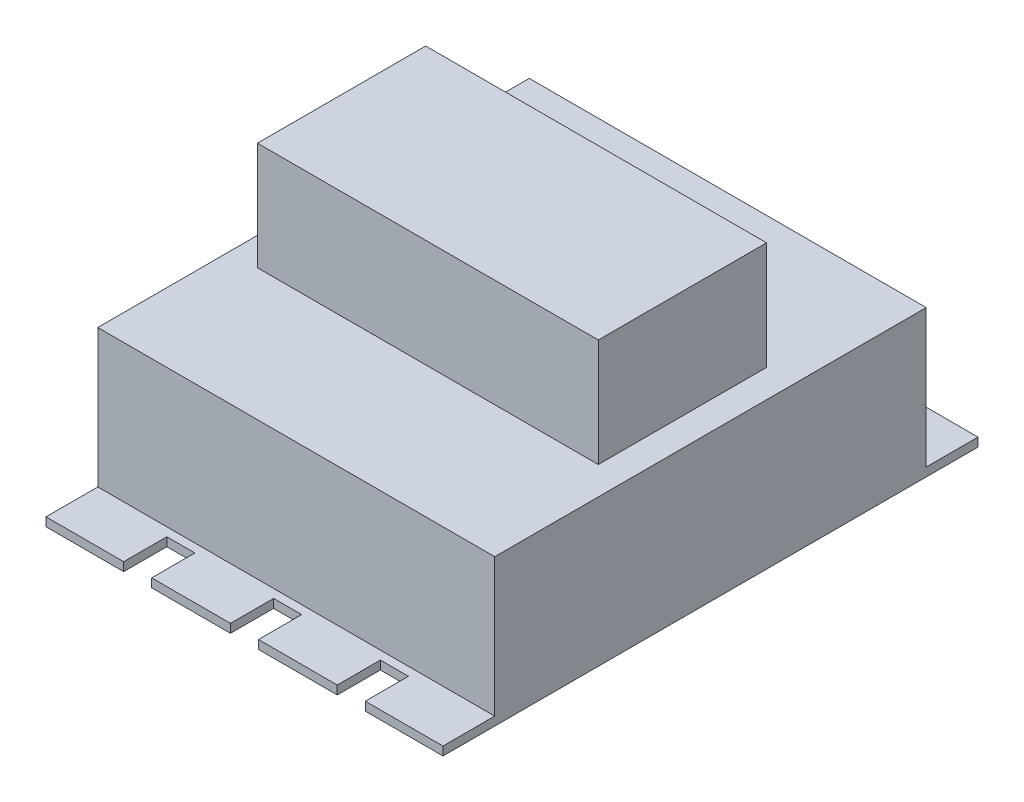
ISO-10303-21;
HEADER;
FILE_DESCRIPTION(('STEP AP214'),'2;1');
FILE_NAME('part.step','',(''),(''),'','','');
FILE_SCHEMA(('AUTOMOTIVE_DESIGN { 1 0 10303 214 1 1 1 1 }'));
ENDSEC;
DATA;
#1=APPLICATION_CONTEXT('core data for automotive mechanical design processes');
#2=APPLICATION_PROTOCOL_DEFINITION('international standard','automotive_design',2000,#1);
#3=PRODUCT_CONTEXT('',#1,'mechanical');
#4=PRODUCT('Part','Part','',(#3));
#5=PRODUCT_RELATED_PRODUCT_CATEGORY('part','',(#4));
#6=PRODUCT_DEFINITION_FORMATION('','',#4);
#7=PRODUCT_DEFINITION_CONTEXT('part definition',#1,'design');
#8=PRODUCT_DEFINITION('design','',#6,#7);
#9=PRODUCT_DEFINITION_SHAPE('','',#8);
#10=(LENGTH_UNIT() NAMED_UNIT(*) SI_UNIT(.MILLI.,.METRE.));
#11=(NAMED_UNIT(*) PLANE_ANGLE_UNIT() SI_UNIT($,.RADIAN.));
#12=(NAMED_UNIT(*) SI_UNIT($,.STERADIAN.) SOLID_ANGLE_UNIT());
#13=UNCERTAINTY_MEASURE_WITH_UNIT(LENGTH_MEASURE(1.E-05),#10,'distance_accuracy_value','');
#14=(GEOMETRIC_REPRESENTATION_CONTEXT(3) GLOBAL_UNCERTAINTY_ASSIGNED_CONTEXT((#13)) GLOBAL_UNIT_ASSIGNED_CONTEXT((#10,
#11,#12)) REPRESENTATION_CONTEXT('',''));
#15=CARTESIAN_POINT('',(0.,0.,0.));
#16=DIRECTION('',(0.,0.,1.));
#17=DIRECTION('',(1.,0.,0.));
#18=AXIS2_PLACEMENT_3D('',#15,#16,#17);
#19=CARTESIAN_POINT('',(0.,34.,0.));
#20=DIRECTION('',(0.,0.,-1.));
#21=DIRECTION('',(-1.,0.,0.));
#22=AXIS2_PLACEMENT_3D('',#19,#20,#21);
#23=PLANE('',#22);
#24=DIRECTION('',(-1.,0.,0.));
#25=VECTOR('',#24,1.);
#26=CARTESIAN_POINT('',(0.,2.,0.));
#27=LINE('',#26,#25);
#28=CARTESIAN_POINT('',(92.,2.,0.));
#29=VERTEX_POINT('',#28);
#30=CARTESIAN_POINT('',(0.,2.,0.));
#31=VERTEX_POINT('',#30);
#32=EDGE_CURVE('E54',#29,#31,#27,.T.);
#33=ORIENTED_EDGE('',*,*,#32,.F.);
#34=DIRECTION('',(0.,-1.,0.));
#35=VECTOR('',#34,1.);
#36=CARTESIAN_POINT('',(92.,34.,0.));
#37=LINE('',#36,#35);
#38=CARTESIAN_POINT('',(92.,34.,0.));
#39=VERTEX_POINT('',#38);
#40=EDGE_CURVE('E554',#39,#29,#37,.T.);
#41=ORIENTED_EDGE('',*,*,#40,.F.);
#42=DIRECTION('',(1.,0.,0.));
#43=VECTOR('',#42,1.);
#44=CARTESIAN_POINT('',(0.,34.,0.));
#45=LINE('',#44,#43);
#46=CARTESIAN_POINT('',(0.,34.,0.));
#47=VERTEX_POINT('',#46);
#48=EDGE_CURVE('E542',#47,#39,#45,.T.);
#49=ORIENTED_EDGE('',*,*,#48,.F.);
#50=DIRECTION('',(0.,-1.,0.));
#51=VECTOR('',#50,1.);
#52=CARTESIAN_POINT('',(0.,34.,0.));
#53=LINE('',#52,#51);
#54=EDGE_CURVE('E44',#47,#31,#53,.T.);
#55=ORIENTED_EDGE('',*,*,#54,.T.);
#56=EDGE_LOOP('',(#33,#41,#49,#55));
#57=FACE_BOUND('',#56,.T.);
#58=ADVANCED_FACE('F36',(#57),#23,.F.);
#59=CARTESIAN_POINT('',(0.,34.,-100.));
#60=DIRECTION('',(0.,0.,1.));
#61=DIRECTION('',(1.,0.,0.));
#62=AXIS2_PLACEMENT_3D('',#59,#60,#61);
#63=PLANE('',#62);
#64=DIRECTION('',(1.,0.,0.));
#65=VECTOR('',#64,1.);
#66=CARTESIAN_POINT('',(0.,2.,-100.));
#67=LINE('',#66,#65);
#68=CARTESIAN_POINT('',(0.,2.,-100.));
#69=VERTEX_POINT('',#68);
#70=CARTESIAN_POINT('',(92.,2.,-100.));
#71=VERTEX_POINT('',#70);
#72=EDGE_CURVE('E11',#69,#71,#67,.T.);
#73=ORIENTED_EDGE('',*,*,#72,.F.);
#74=DIRECTION('',(0.,-1.,0.));
#75=VECTOR('',#74,1.);
#76=CARTESIAN_POINT('',(0.,34.,-100.));
#77=LINE('',#76,#75);
#78=CARTESIAN_POINT('',(0.,34.,-100.));
#79=VERTEX_POINT('',#78);
#80=EDGE_CURVE('E274',#79,#69,#77,.T.);
#81=ORIENTED_EDGE('',*,*,#80,.F.);
#82=DIRECTION('',(-1.,0.,0.));
#83=VECTOR('',#82,1.);
#84=CARTESIAN_POINT('',(0.,34.,-100.));
#85=LINE('',#84,#83);
#86=CARTESIAN_POINT('',(92.,34.,-100.));
#87=VERTEX_POINT('',#86);
#88=EDGE_CURVE('E547',#87,#79,#85,.T.);
#89=ORIENTED_EDGE('',*,*,#88,.F.);
#90=DIRECTION('',(0.,-1.,0.));
#91=VECTOR('',#90,1.);
#92=CARTESIAN_POINT('',(92.,34.,-100.));
#93=LINE('',#92,#91);
#94=EDGE_CURVE('E552',#87,#71,#93,.T.);
#95=ORIENTED_EDGE('',*,*,#94,.T.);
#96=EDGE_LOOP('',(#73,#81,#89,#95));
#97=FACE_BOUND('',#96,.T.);
#98=ADVANCED_FACE('F586',(#97),#63,.F.);
#99=CARTESIAN_POINT('',(0.,34.,0.));
#100=DIRECTION('',(0.,-1.,0.));
#101=DIRECTION('',(0.,0.,-1.));
#102=AXIS2_PLACEMENT_3D('',#99,#100,#101);
#103=PLANE('',#102);
#104=DIRECTION('',(0.,0.,1.));
#105=VECTOR('',#104,1.);
#106=CARTESIAN_POINT('',(0.,34.,0.));
#107=LINE('',#106,#105);
#108=EDGE_CURVE('E539',#79,#47,#107,.T.);
#109=ORIENTED_EDGE('',*,*,#108,.T.);
#110=ORIENTED_EDGE('',*,*,#48,.T.);
#111=DIRECTION('',(0.,0.,-1.));
#112=VECTOR('',#111,1.);
#113=CARTESIAN_POINT('',(92.,34.,0.));
#114=LINE('',#113,#112);
#115=EDGE_CURVE('E545',#39,#87,#114,.T.);
#116=ORIENTED_EDGE('',*,*,#115,.T.);
#117=ORIENTED_EDGE('',*,*,#88,.T.);
#118=EDGE_LOOP('',(#109,#110,#116,#117));
#119=FACE_BOUND('',#118,.T.);
#120=DIRECTION('',(0.,0.,1.));
#121=VECTOR('',#120,1.);
#122=CARTESIAN_POINT('',(6.50000000000001,34.,-69.5));
#123=LINE('',#122,#121);
#124=CARTESIAN_POINT('',(6.50000000000001,34.,-69.5));
#125=VERTEX_POINT('',#124);
#126=CARTESIAN_POINT('',(6.50000000000001,34.,-30.5));
#127=VERTEX_POINT('',#126);
#128=EDGE_CURVE('E505',#125,#127,#123,.T.);
#129=ORIENTED_EDGE('',*,*,#128,.F.);
#130=DIRECTION('',(-1.,0.,0.));
#131=VECTOR('',#130,1.);
#132=CARTESIAN_POINT('',(6.50000000000001,34.,-69.5));
#133=LINE('',#132,#131);
#134=CARTESIAN_POINT('',(85.5,34.,-69.5));
#135=VERTEX_POINT('',#134);
#136=EDGE_CURVE('E510',#135,#125,#133,.T.);
#137=ORIENTED_EDGE('',*,*,#136,.F.);
#138=DIRECTION('',(0.,0.,-1.));
#139=VECTOR('',#138,1.);
#140=CARTESIAN_POINT('',(85.5,34.,-69.5));
#141=LINE('',#140,#139);
#142=CARTESIAN_POINT('',(85.5,34.,-30.5));
#143=VERTEX_POINT('',#142);
#144=EDGE_CURVE('E522',#143,#135,#141,.T.);
#145=ORIENTED_EDGE('',*,*,#144,.F.);
#146=DIRECTION('',(1.,0.,0.));
#147=VECTOR('',#146,1.);
#148=CARTESIAN_POINT('',(6.50000000000001,34.,-30.5));
#149=LINE('',#148,#147);
#150=EDGE_CURVE('E519',#127,#143,#149,.T.);
#151=ORIENTED_EDGE('',*,*,#150,.F.);
#152=EDGE_LOOP('',(#129,#137,#145,#151));
#153=FACE_BOUND('',#152,.T.);
#154=ADVANCED_FACE('F588',(#119,#153),#103,.F.);
#155=CARTESIAN_POINT('',(0.,34.,0.));
#156=DIRECTION('',(1.,0.,0.));
#157=DIRECTION('',(0.,0.,-1.));
#158=AXIS2_PLACEMENT_3D('',#155,#156,#157);
#159=PLANE('',#158);
#160=DIRECTION('',(0.,0.,1.));
#161=VECTOR('',#160,1.);
#162=CARTESIAN_POINT('',(0.,0.,0.));
#163=LINE('',#162,#161);
#164=CARTESIAN_POINT('',(0.,0.,-112.));
#165=VERTEX_POINT('',#164);
#166=CARTESIAN_POINT('',(0.,0.,12.));
#167=VERTEX_POINT('',#166);
#168=EDGE_CURVE('E538',#165,#167,#163,.T.);
#169=ORIENTED_EDGE('',*,*,#168,.T.);
#170=DIRECTION('',(0.,-1.,0.));
#171=VECTOR('',#170,1.);
#172=CARTESIAN_POINT('',(0.,2.,12.));
#173=LINE('',#172,#171);
#174=CARTESIAN_POINT('',(0.,2.,12.));
#175=VERTEX_POINT('',#174);
#176=EDGE_CURVE('E448',#175,#167,#173,.T.);
#177=ORIENTED_EDGE('',*,*,#176,.F.);
#178=DIRECTION('',(0.,0.,-1.));
#179=VECTOR('',#178,1.);
#180=CARTESIAN_POINT('',(0.,2.,12.));
#181=LINE('',#180,#179);
#182=EDGE_CURVE('E277',#175,#31,#181,.T.);
#183=ORIENTED_EDGE('',*,*,#182,.T.);
#184=ORIENTED_EDGE('',*,*,#54,.F.);
#185=ORIENTED_EDGE('',*,*,#108,.F.);
#186=ORIENTED_EDGE('',*,*,#80,.T.);
#187=CARTESIAN_POINT('',(0.,2.,-112.));
#188=VERTEX_POINT('',#187);
#189=EDGE_CURVE('E268',#69,#188,#181,.T.);
#190=ORIENTED_EDGE('',*,*,#189,.T.);
#191=DIRECTION('',(0.,-1.,0.));
#192=VECTOR('',#191,1.);
#193=CARTESIAN_POINT('',(0.,2.,-112.));
#194=LINE('',#193,#192);
#195=EDGE_CURVE('E270',#188,#165,#194,.T.);
#196=ORIENTED_EDGE('',*,*,#195,.T.);
#197=EDGE_LOOP('',(#169,#177,#183,#184,#185,#186,#190,#196));
#198=FACE_BOUND('',#197,.T.);
#199=ADVANCED_FACE('F38',(#198),#159,.F.);
#200=CARTESIAN_POINT('',(92.,34.,0.));
#201=DIRECTION('',(-1.,0.,0.));
#202=DIRECTION('',(0.,0.,1.));
#203=AXIS2_PLACEMENT_3D('',#200,#201,#202);
#204=PLANE('',#203);
#205=DIRECTION('',(0.,0.,-1.));
#206=VECTOR('',#205,1.);
#207=CARTESIAN_POINT('',(92.,0.,0.));
#208=LINE('',#207,#206);
#209=CARTESIAN_POINT('',(92.,0.,12.));
#210=VERTEX_POINT('',#209);
#211=CARTESIAN_POINT('',(92.,0.,-112.));
#212=VERTEX_POINT('',#211);
#213=EDGE_CURVE('E543',#210,#212,#208,.T.);
#214=ORIENTED_EDGE('',*,*,#213,.T.);
#215=DIRECTION('',(0.,-1.,0.));
#216=VECTOR('',#215,1.);
#217=CARTESIAN_POINT('',(92.,2.,-112.));
#218=LINE('',#217,#216);
#219=CARTESIAN_POINT('',(92.,2.,-112.));
#220=VERTEX_POINT('',#219);
#221=EDGE_CURVE('E478',#220,#212,#218,.T.);
#222=ORIENTED_EDGE('',*,*,#221,.F.);
#223=DIRECTION('',(0.,0.,1.));
#224=VECTOR('',#223,1.);
#225=CARTESIAN_POINT('',(92.,2.,12.));
#226=LINE('',#225,#224);
#227=EDGE_CURVE('E332',#220,#71,#226,.T.);
#228=ORIENTED_EDGE('',*,*,#227,.T.);
#229=ORIENTED_EDGE('',*,*,#94,.F.);
#230=ORIENTED_EDGE('',*,*,#115,.F.);
#231=ORIENTED_EDGE('',*,*,#40,.T.);
#232=CARTESIAN_POINT('',(92.,2.,12.));
#233=VERTEX_POINT('',#232);
#234=EDGE_CURVE('E331',#29,#233,#226,.T.);
#235=ORIENTED_EDGE('',*,*,#234,.T.);
#236=DIRECTION('',(0.,-1.,0.));
#237=VECTOR('',#236,1.);
#238=CARTESIAN_POINT('',(92.,2.,12.));
#239=LINE('',#238,#237);
#240=EDGE_CURVE('E475',#233,#210,#239,.T.);
#241=ORIENTED_EDGE('',*,*,#240,.T.);
#242=EDGE_LOOP('',(#214,#222,#228,#229,#230,#231,#235,#241));
#243=FACE_BOUND('',#242,.T.);
#244=ADVANCED_FACE('F558',(#243),#204,.F.);
#245=CARTESIAN_POINT('',(0.,0.,0.));
#246=DIRECTION('',(0.,-1.,0.));
#247=DIRECTION('',(0.,0.,-1.));
#248=AXIS2_PLACEMENT_3D('',#245,#246,#247);
#249=PLANE('',#248);
#250=ORIENTED_EDGE('',*,*,#168,.F.);
#251=DIRECTION('',(1.,0.,0.));
#252=VECTOR('',#251,1.);
#253=CARTESIAN_POINT('',(0.,0.,-112.));
#254=LINE('',#253,#252);
#255=CARTESIAN_POINT('',(18.,0.,-112.));
#256=VERTEX_POINT('',#255);
#257=EDGE_CURVE('E285',#165,#256,#254,.T.);
#258=ORIENTED_EDGE('',*,*,#257,.T.);
#259=DIRECTION('',(0.,0.,1.));
#260=VECTOR('',#259,1.);
#261=CARTESIAN_POINT('',(18.,0.,-112.));
#262=LINE('',#261,#260);
#263=CARTESIAN_POINT('',(18.,0.,-102.));
#264=VERTEX_POINT('',#263);
#265=EDGE_CURVE('E374',#256,#264,#262,.T.);
#266=ORIENTED_EDGE('',*,*,#265,.T.);
#267=DIRECTION('',(1.,0.,0.));
#268=VECTOR('',#267,1.);
#269=CARTESIAN_POINT('',(18.,0.,-102.));
#270=LINE('',#269,#268);
#271=CARTESIAN_POINT('',(24.5,0.,-102.));
#272=VERTEX_POINT('',#271);
#273=EDGE_CURVE('E377',#264,#272,#270,.T.);
#274=ORIENTED_EDGE('',*,*,#273,.T.);
#275=DIRECTION('',(0.,0.,-1.));
#276=VECTOR('',#275,1.);
#277=CARTESIAN_POINT('',(24.5,0.,-112.));
#278=LINE('',#277,#276);
#279=CARTESIAN_POINT('',(24.5,0.,-112.));
#280=VERTEX_POINT('',#279);
#281=EDGE_CURVE('E380',#272,#280,#278,.T.);
#282=ORIENTED_EDGE('',*,*,#281,.T.);
#283=DIRECTION('',(1.,0.,0.));
#284=VECTOR('',#283,1.);
#285=CARTESIAN_POINT('',(24.5,0.,-112.));
#286=LINE('',#285,#284);
#287=CARTESIAN_POINT('',(42.75,0.,-112.));
#288=VERTEX_POINT('',#287);
#289=EDGE_CURVE('E383',#280,#288,#286,.T.);
#290=ORIENTED_EDGE('',*,*,#289,.T.);
#291=DIRECTION('',(0.,0.,1.));
#292=VECTOR('',#291,1.);
#293=CARTESIAN_POINT('',(42.75,0.,-112.));
#294=LINE('',#293,#292);
#295=CARTESIAN_POINT('',(42.75,0.,-102.));
#296=VERTEX_POINT('',#295);
#297=EDGE_CURVE('E386',#288,#296,#294,.T.);
#298=ORIENTED_EDGE('',*,*,#297,.T.);
#299=DIRECTION('',(1.,0.,0.));
#300=VECTOR('',#299,1.);
#301=CARTESIAN_POINT('',(42.75,0.,-102.));
#302=LINE('',#301,#300);
#303=CARTESIAN_POINT('',(49.25,0.,-102.));
#304=VERTEX_POINT('',#303);
#305=EDGE_CURVE('E389',#296,#304,#302,.T.);
#306=ORIENTED_EDGE('',*,*,#305,.T.);
#307=DIRECTION('',(0.,0.,-1.));
#308=VECTOR('',#307,1.);
#309=CARTESIAN_POINT('',(49.25,0.,-112.));
#310=LINE('',#309,#308);
#311=CARTESIAN_POINT('',(49.25,0.,-112.));
#312=VERTEX_POINT('',#311);
#313=EDGE_CURVE('E392',#304,#312,#310,.T.);
#314=ORIENTED_EDGE('',*,*,#313,.T.);
#315=DIRECTION('',(1.,0.,0.));
#316=VECTOR('',#315,1.);
#317=CARTESIAN_POINT('',(49.25,0.,-112.));
#318=LINE('',#317,#316);
#319=CARTESIAN_POINT('',(67.5,0.,-112.));
#320=VERTEX_POINT('',#319);
#321=EDGE_CURVE('E395',#312,#320,#318,.T.);
#322=ORIENTED_EDGE('',*,*,#321,.T.);
#323=DIRECTION('',(0.,0.,1.));
#324=VECTOR('',#323,1.);
#325=CARTESIAN_POINT('',(67.5,0.,-112.));
#326=LINE('',#325,#324);
#327=CARTESIAN_POINT('',(67.5,0.,-102.));
#328=VERTEX_POINT('',#327);
#329=EDGE_CURVE('E398',#320,#328,#326,.T.);
#330=ORIENTED_EDGE('',*,*,#329,.T.);
#331=DIRECTION('',(1.,0.,0.));
#332=VECTOR('',#331,1.);
#333=CARTESIAN_POINT('',(74.,0.,-102.));
#334=LINE('',#333,#332);
#335=CARTESIAN_POINT('',(74.,0.,-102.));
#336=VERTEX_POINT('',#335);
#337=EDGE_CURVE('E401',#328,#336,#334,.T.);
#338=ORIENTED_EDGE('',*,*,#337,.T.);
#339=DIRECTION('',(0.,0.,-1.));
#340=VECTOR('',#339,1.);
#341=CARTESIAN_POINT('',(74.,0.,-112.));
#342=LINE('',#341,#340);
#343=CARTESIAN_POINT('',(74.,0.,-112.));
#344=VERTEX_POINT('',#343);
#345=EDGE_CURVE('E404',#336,#344,#342,.T.);
#346=ORIENTED_EDGE('',*,*,#345,.T.);
#347=DIRECTION('',(1.,0.,0.));
#348=VECTOR('',#347,1.);
#349=CARTESIAN_POINT('',(74.,0.,-112.));
#350=LINE('',#349,#348);
#351=EDGE_CURVE('E407',#344,#212,#350,.T.);
#352=ORIENTED_EDGE('',*,*,#351,.T.);
#353=ORIENTED_EDGE('',*,*,#213,.F.);
#354=DIRECTION('',(-1.,0.,0.));
#355=VECTOR('',#354,1.);
#356=CARTESIAN_POINT('',(74.,0.,12.));
#357=LINE('',#356,#355);
#358=CARTESIAN_POINT('',(74.,0.,12.));
#359=VERTEX_POINT('',#358);
#360=EDGE_CURVE('E410',#210,#359,#357,.T.);
#361=ORIENTED_EDGE('',*,*,#360,.T.);
#362=DIRECTION('',(0.,0.,-1.));
#363=VECTOR('',#362,1.);
#364=CARTESIAN_POINT('',(74.,0.,12.));
#365=LINE('',#364,#363);
#366=CARTESIAN_POINT('',(74.,0.,2.));
#367=VERTEX_POINT('',#366);
#368=EDGE_CURVE('E413',#359,#367,#365,.T.);
#369=ORIENTED_EDGE('',*,*,#368,.T.);
#370=DIRECTION('',(-1.,0.,0.));
#371=VECTOR('',#370,1.);
#372=CARTESIAN_POINT('',(74.,0.,2.));
#373=LINE('',#372,#371);
#374=CARTESIAN_POINT('',(67.5,0.,2.));
#375=VERTEX_POINT('',#374);
#376=EDGE_CURVE('E416',#367,#375,#373,.T.);
#377=ORIENTED_EDGE('',*,*,#376,.T.);
#378=DIRECTION('',(0.,0.,1.));
#379=VECTOR('',#378,1.);
#380=CARTESIAN_POINT('',(67.5,0.,12.));
#381=LINE('',#380,#379);
#382=CARTESIAN_POINT('',(67.5,0.,12.));
#383=VERTEX_POINT('',#382);
#384=EDGE_CURVE('E419',#375,#383,#381,.T.);
#385=ORIENTED_EDGE('',*,*,#384,.T.);
#386=DIRECTION('',(-1.,0.,0.));
#387=VECTOR('',#386,1.);
#388=CARTESIAN_POINT('',(49.25,0.,12.));
#389=LINE('',#388,#387);
#390=CARTESIAN_POINT('',(49.25,0.,12.));
#391=VERTEX_POINT('',#390);
#392=EDGE_CURVE('E422',#383,#391,#389,.T.);
#393=ORIENTED_EDGE('',*,*,#392,.T.);
#394=DIRECTION('',(0.,0.,-1.));
#395=VECTOR('',#394,1.);
#396=CARTESIAN_POINT('',(49.25,0.,12.));
#397=LINE('',#396,#395);
#398=CARTESIAN_POINT('',(49.25,0.,2.));
#399=VERTEX_POINT('',#398);
#400=EDGE_CURVE('E425',#391,#399,#397,.T.);
#401=ORIENTED_EDGE('',*,*,#400,.T.);
#402=DIRECTION('',(-1.,0.,0.));
#403=VECTOR('',#402,1.);
#404=CARTESIAN_POINT('',(42.75,0.,2.));
#405=LINE('',#404,#403);
#406=CARTESIAN_POINT('',(42.75,0.,2.));
#407=VERTEX_POINT('',#406);
#408=EDGE_CURVE('E428',#399,#407,#405,.T.);
#409=ORIENTED_EDGE('',*,*,#408,.T.);
#410=DIRECTION('',(0.,0.,1.));
#411=VECTOR('',#410,1.);
#412=CARTESIAN_POINT('',(42.75,0.,12.));
#413=LINE('',#412,#411);
#414=CARTESIAN_POINT('',(42.75,0.,12.));
#415=VERTEX_POINT('',#414);
#416=EDGE_CURVE('E431',#407,#415,#413,.T.);
#417=ORIENTED_EDGE('',*,*,#416,.T.);
#418=DIRECTION('',(-1.,0.,0.));
#419=VECTOR('',#418,1.);
#420=CARTESIAN_POINT('',(24.5,0.,12.));
#421=LINE('',#420,#419);
#422=CARTESIAN_POINT('',(24.5,0.,12.));
#423=VERTEX_POINT('',#422);
#424=EDGE_CURVE('E434',#415,#423,#421,.T.);
#425=ORIENTED_EDGE('',*,*,#424,.T.);
#426=DIRECTION('',(0.,0.,-1.));
#427=VECTOR('',#426,1.);
#428=CARTESIAN_POINT('',(24.5,0.,12.));
#429=LINE('',#428,#427);
#430=CARTESIAN_POINT('',(24.5,0.,2.));
#431=VERTEX_POINT('',#430);
#432=EDGE_CURVE('E437',#423,#431,#429,.T.);
#433=ORIENTED_EDGE('',*,*,#432,.T.);
#434=DIRECTION('',(-1.,0.,0.));
#435=VECTOR('',#434,1.);
#436=CARTESIAN_POINT('',(18.,0.,2.));
#437=LINE('',#436,#435);
#438=CARTESIAN_POINT('',(18.,0.,2.));
#439=VERTEX_POINT('',#438);
#440=EDGE_CURVE('E440',#431,#439,#437,.T.);
#441=ORIENTED_EDGE('',*,*,#440,.T.);
#442=DIRECTION('',(0.,0.,1.));
#443=VECTOR('',#442,1.);
#444=CARTESIAN_POINT('',(18.,0.,12.));
#445=LINE('',#444,#443);
#446=CARTESIAN_POINT('',(18.,0.,12.));
#447=VERTEX_POINT('',#446);
#448=EDGE_CURVE('E443',#439,#447,#445,.T.);
#449=ORIENTED_EDGE('',*,*,#448,.T.);
#450=DIRECTION('',(-1.,0.,0.));
#451=VECTOR('',#450,1.);
#452=CARTESIAN_POINT('',(0.,0.,12.));
#453=LINE('',#452,#451);
#454=EDGE_CURVE('E278',#447,#167,#453,.T.);
#455=ORIENTED_EDGE('',*,*,#454,.T.);
#456=EDGE_LOOP('',(#250,#258,#266,#274,#282,#290,#298,#306,#314,#322,#330,#338,#346,#352,#353,
#361,#369,#377,#385,#393,#401,#409,#417,#425,#433,#441,#449,#455));
#457=FACE_BOUND('',#456,.T.);
#458=ADVANCED_FACE('F577',(#457),#249,.T.);
#459=CARTESIAN_POINT('',(6.50000000000001,59.,-69.5));
#460=DIRECTION('',(1.,0.,0.));
#461=DIRECTION('',(0.,0.,-1.));
#462=AXIS2_PLACEMENT_3D('',#459,#460,#461);
#463=PLANE('',#462);
#464=ORIENTED_EDGE('',*,*,#128,.T.);
#465=DIRECTION('',(0.,-1.,0.));
#466=VECTOR('',#465,1.);
#467=CARTESIAN_POINT('',(6.50000000000001,59.,-30.5));
#468=LINE('',#467,#466);
#469=CARTESIAN_POINT('',(6.50000000000001,59.,-30.5));
#470=VERTEX_POINT('',#469);
#471=EDGE_CURVE('E535',#470,#127,#468,.T.);
#472=ORIENTED_EDGE('',*,*,#471,.F.);
#473=DIRECTION('',(0.,0.,1.));
#474=VECTOR('',#473,1.);
#475=CARTESIAN_POINT('',(6.50000000000001,59.,-69.5));
#476=LINE('',#475,#474);
#477=CARTESIAN_POINT('',(6.50000000000001,59.,-69.5));
#478=VERTEX_POINT('',#477);
#479=EDGE_CURVE('E506',#478,#470,#476,.T.);
#480=ORIENTED_EDGE('',*,*,#479,.F.);
#481=DIRECTION('',(0.,-1.,0.));
#482=VECTOR('',#481,1.);
#483=CARTESIAN_POINT('',(6.50000000000001,59.,-69.5));
#484=LINE('',#483,#482);
#485=EDGE_CURVE('E516',#478,#125,#484,.T.);
#486=ORIENTED_EDGE('',*,*,#485,.T.);
#487=EDGE_LOOP('',(#464,#472,#480,#486));
#488=FACE_BOUND('',#487,.T.);
#489=ADVANCED_FACE('F600',(#488),#463,.F.);
#490=CARTESIAN_POINT('',(6.50000000000001,59.,-30.5));
#491=DIRECTION('',(0.,0.,-1.));
#492=DIRECTION('',(-1.,0.,0.));
#493=AXIS2_PLACEMENT_3D('',#490,#491,#492);
#494=PLANE('',#493);
#495=ORIENTED_EDGE('',*,*,#150,.T.);
#496=DIRECTION('',(0.,-1.,0.));
#497=VECTOR('',#496,1.);
#498=CARTESIAN_POINT('',(85.5,59.,-30.5));
#499=LINE('',#498,#497);
#500=CARTESIAN_POINT('',(85.5,59.,-30.5));
#501=VERTEX_POINT('',#500);
#502=EDGE_CURVE('E532',#501,#143,#499,.T.);
#503=ORIENTED_EDGE('',*,*,#502,.F.);
#504=DIRECTION('',(1.,0.,0.));
#505=VECTOR('',#504,1.);
#506=CARTESIAN_POINT('',(6.50000000000001,59.,-30.5));
#507=LINE('',#506,#505);
#508=EDGE_CURVE('E509',#470,#501,#507,.T.);
#509=ORIENTED_EDGE('',*,*,#508,.F.);
#510=ORIENTED_EDGE('',*,*,#471,.T.);
#511=EDGE_LOOP('',(#495,#503,#509,#510));
#512=FACE_BOUND('',#511,.T.);
#513=ADVANCED_FACE('F605',(#512),#494,.F.);
#514=CARTESIAN_POINT('',(85.5,59.,-69.5));
#515=DIRECTION('',(-1.,0.,0.));
#516=DIRECTION('',(0.,0.,1.));
#517=AXIS2_PLACEMENT_3D('',#514,#515,#516);
#518=PLANE('',#517);
#519=ORIENTED_EDGE('',*,*,#144,.T.);
#520=DIRECTION('',(0.,-1.,0.));
#521=VECTOR('',#520,1.);
#522=CARTESIAN_POINT('',(85.5,59.,-69.5));
#523=LINE('',#522,#521);
#524=CARTESIAN_POINT('',(85.5,59.,-69.5));
#525=VERTEX_POINT('',#524);
#526=EDGE_CURVE('E529',#525,#135,#523,.T.);
#527=ORIENTED_EDGE('',*,*,#526,.F.);
#528=DIRECTION('',(0.,0.,-1.));
#529=VECTOR('',#528,1.);
#530=CARTESIAN_POINT('',(85.5,59.,-69.5));
#531=LINE('',#530,#529);
#532=EDGE_CURVE('E512',#501,#525,#531,.T.);
#533=ORIENTED_EDGE('',*,*,#532,.F.);
#534=ORIENTED_EDGE('',*,*,#502,.T.);
#535=EDGE_LOOP('',(#519,#527,#533,#534));
#536=FACE_BOUND('',#535,.T.);
#537=ADVANCED_FACE('F609',(#536),#518,.F.);
#538=CARTESIAN_POINT('',(6.50000000000001,59.,-69.5));
#539=DIRECTION('',(0.,0.,1.));
#540=DIRECTION('',(1.,0.,0.));
#541=AXIS2_PLACEMENT_3D('',#538,#539,#540);
#542=PLANE('',#541);
#543=ORIENTED_EDGE('',*,*,#136,.T.);
#544=ORIENTED_EDGE('',*,*,#485,.F.);
#545=DIRECTION('',(-1.,0.,0.));
#546=VECTOR('',#545,1.);
#547=CARTESIAN_POINT('',(6.50000000000001,59.,-69.5));
#548=LINE('',#547,#546);
#549=EDGE_CURVE('E514',#525,#478,#548,.T.);
#550=ORIENTED_EDGE('',*,*,#549,.F.);
#551=ORIENTED_EDGE('',*,*,#526,.T.);
#552=EDGE_LOOP('',(#543,#544,#550,#551));
#553=FACE_BOUND('',#552,.T.);
#554=ADVANCED_FACE('F613',(#553),#542,.F.);
#555=CARTESIAN_POINT('',(0.,59.,0.));
#556=DIRECTION('',(0.,1.,0.));
#557=DIRECTION('',(0.,0.,1.));
#558=AXIS2_PLACEMENT_3D('',#555,#556,#557);
#559=PLANE('',#558);
#560=ORIENTED_EDGE('',*,*,#479,.T.);
#561=ORIENTED_EDGE('',*,*,#508,.T.);
#562=ORIENTED_EDGE('',*,*,#532,.T.);
#563=ORIENTED_EDGE('',*,*,#549,.T.);
#564=EDGE_LOOP('',(#560,#561,#562,#563));
#565=FACE_BOUND('',#564,.T.);
#566=ADVANCED_FACE('F617',(#565),#559,.T.);
#567=CARTESIAN_POINT('',(74.,2.,-112.));
#568=DIRECTION('',(0.,0.,-1.));
#569=DIRECTION('',(-1.,0.,0.));
#570=AXIS2_PLACEMENT_3D('',#567,#568,#569);
#571=PLANE('',#570);
#572=ORIENTED_EDGE('',*,*,#351,.F.);
#573=DIRECTION('',(0.,-1.,0.));
#574=VECTOR('',#573,1.);
#575=CARTESIAN_POINT('',(74.,2.,-112.));
#576=LINE('',#575,#574);
#577=CARTESIAN_POINT('',(74.,2.,-112.));
#578=VERTEX_POINT('',#577);
#579=EDGE_CURVE('E481',#578,#344,#576,.T.);
#580=ORIENTED_EDGE('',*,*,#579,.F.);
#581=DIRECTION('',(1.,0.,0.));
#582=VECTOR('',#581,1.);
#583=CARTESIAN_POINT('',(74.,2.,-112.));
#584=LINE('',#583,#582);
#585=EDGE_CURVE('E328',#578,#220,#584,.T.);
#586=ORIENTED_EDGE('',*,*,#585,.T.);
#587=ORIENTED_EDGE('',*,*,#221,.T.);
#588=EDGE_LOOP('',(#572,#580,#586,#587));
#589=FACE_BOUND('',#588,.T.);
#590=ADVANCED_FACE('F575',(#589),#571,.T.);
#591=CARTESIAN_POINT('',(74.,2.,-112.));
#592=DIRECTION('',(-1.,0.,0.));
#593=DIRECTION('',(0.,0.,1.));
#594=AXIS2_PLACEMENT_3D('',#591,#592,#593);
#595=PLANE('',#594);
#596=ORIENTED_EDGE('',*,*,#345,.F.);
#597=DIRECTION('',(0.,-1.,0.));
#598=VECTOR('',#597,1.);
#599=CARTESIAN_POINT('',(74.,2.,-102.));
#600=LINE('',#599,#598);
#601=CARTESIAN_POINT('',(74.,2.,-102.));
#602=VERTEX_POINT('',#601);
#603=EDGE_CURVE('E483',#602,#336,#600,.T.);
#604=ORIENTED_EDGE('',*,*,#603,.F.);
#605=DIRECTION('',(0.,0.,-1.));
#606=VECTOR('',#605,1.);
#607=CARTESIAN_POINT('',(74.,2.,-112.));
#608=LINE('',#607,#606);
#609=EDGE_CURVE('E325',#602,#578,#608,.T.);
#610=ORIENTED_EDGE('',*,*,#609,.T.);
#611=ORIENTED_EDGE('',*,*,#579,.T.);
#612=EDGE_LOOP('',(#596,#604,#610,#611));
#613=FACE_BOUND('',#612,.T.);
#614=ADVANCED_FACE('F581',(#613),#595,.T.);
#615=CARTESIAN_POINT('',(74.,2.,-102.));
#616=DIRECTION('',(0.,0.,-1.));
#617=DIRECTION('',(-1.,0.,0.));
#618=AXIS2_PLACEMENT_3D('',#615,#616,#617);
#619=PLANE('',#618);
#620=ORIENTED_EDGE('',*,*,#337,.F.);
#621=DIRECTION('',(0.,-1.,0.));
#622=VECTOR('',#621,1.);
#623=CARTESIAN_POINT('',(67.5,2.,-102.));
#624=LINE('',#623,#622);
#625=CARTESIAN_POINT('',(67.5,2.,-102.));
#626=VERTEX_POINT('',#625);
#627=EDGE_CURVE('E485',#626,#328,#624,.T.);
#628=ORIENTED_EDGE('',*,*,#627,.F.);
#629=DIRECTION('',(1.,0.,0.));
#630=VECTOR('',#629,1.);
#631=CARTESIAN_POINT('',(74.,2.,-102.));
#632=LINE('',#631,#630);
#633=EDGE_CURVE('E322',#626,#602,#632,.T.);
#634=ORIENTED_EDGE('',*,*,#633,.T.);
#635=ORIENTED_EDGE('',*,*,#603,.T.);
#636=EDGE_LOOP('',(#620,#628,#634,#635));
#637=FACE_BOUND('',#636,.T.);
#638=ADVANCED_FACE('F659',(#637),#619,.T.);
#639=CARTESIAN_POINT('',(67.5,2.,-112.));
#640=DIRECTION('',(1.,0.,0.));
#641=DIRECTION('',(0.,0.,-1.));
#642=AXIS2_PLACEMENT_3D('',#639,#640,#641);
#643=PLANE('',#642);
#644=ORIENTED_EDGE('',*,*,#329,.F.);
#645=DIRECTION('',(0.,-1.,0.));
#646=VECTOR('',#645,1.);
#647=CARTESIAN_POINT('',(67.5,2.,-112.));
#648=LINE('',#647,#646);
#649=CARTESIAN_POINT('',(67.5,2.,-112.));
#650=VERTEX_POINT('',#649);
#651=EDGE_CURVE('E487',#650,#320,#648,.T.);
#652=ORIENTED_EDGE('',*,*,#651,.F.);
#653=DIRECTION('',(0.,0.,1.));
#654=VECTOR('',#653,1.);
#655=CARTESIAN_POINT('',(67.5,2.,-112.));
#656=LINE('',#655,#654);
#657=EDGE_CURVE('E319',#650,#626,#656,.T.);
#658=ORIENTED_EDGE('',*,*,#657,.T.);
#659=ORIENTED_EDGE('',*,*,#627,.T.);
#660=EDGE_LOOP('',(#644,#652,#658,#659));
#661=FACE_BOUND('',#660,.T.);
#662=ADVANCED_FACE('F655',(#661),#643,.T.);
#663=CARTESIAN_POINT('',(49.25,2.,-112.));
#664=DIRECTION('',(0.,0.,-1.));
#665=DIRECTION('',(-1.,0.,0.));
#666=AXIS2_PLACEMENT_3D('',#663,#664,#665);
#667=PLANE('',#666);
#668=ORIENTED_EDGE('',*,*,#321,.F.);
#669=DIRECTION('',(0.,-1.,0.));
#670=VECTOR('',#669,1.);
#671=CARTESIAN_POINT('',(49.25,2.,-112.));
#672=LINE('',#671,#670);
#673=CARTESIAN_POINT('',(49.25,2.,-112.));
#674=VERTEX_POINT('',#673);
#675=EDGE_CURVE('E489',#674,#312,#672,.T.);
#676=ORIENTED_EDGE('',*,*,#675,.F.);
#677=DIRECTION('',(1.,0.,0.));
#678=VECTOR('',#677,1.);
#679=CARTESIAN_POINT('',(49.25,2.,-112.));
#680=LINE('',#679,#678);
#681=EDGE_CURVE('E316',#674,#650,#680,.T.);
#682=ORIENTED_EDGE('',*,*,#681,.T.);
#683=ORIENTED_EDGE('',*,*,#651,.T.);
#684=EDGE_LOOP('',(#668,#676,#682,#683));
#685=FACE_BOUND('',#684,.T.);
#686=ADVANCED_FACE('F651',(#685),#667,.T.);
#687=CARTESIAN_POINT('',(49.25,2.,-112.));
#688=DIRECTION('',(-1.,0.,0.));
#689=DIRECTION('',(0.,0.,1.));
#690=AXIS2_PLACEMENT_3D('',#687,#688,#689);
#691=PLANE('',#690);
#692=ORIENTED_EDGE('',*,*,#313,.F.);
#693=DIRECTION('',(0.,-1.,0.));
#694=VECTOR('',#693,1.);
#695=CARTESIAN_POINT('',(49.25,2.,-102.));
#696=LINE('',#695,#694);
#697=CARTESIAN_POINT('',(49.25,2.,-102.));
#698=VERTEX_POINT('',#697);
#699=EDGE_CURVE('E491',#698,#304,#696,.T.);
#700=ORIENTED_EDGE('',*,*,#699,.F.);
#701=DIRECTION('',(0.,0.,-1.));
#702=VECTOR('',#701,1.);
#703=CARTESIAN_POINT('',(49.25,2.,-112.));
#704=LINE('',#703,#702);
#705=EDGE_CURVE('E313',#698,#674,#704,.T.);
#706=ORIENTED_EDGE('',*,*,#705,.T.);
#707=ORIENTED_EDGE('',*,*,#675,.T.);
#708=EDGE_LOOP('',(#692,#700,#706,#707));
#709=FACE_BOUND('',#708,.T.);
#710=ADVANCED_FACE('F647',(#709),#691,.T.);
#711=CARTESIAN_POINT('',(42.75,2.,-102.));
#712=DIRECTION('',(0.,0.,-1.));
#713=DIRECTION('',(-1.,0.,0.));
#714=AXIS2_PLACEMENT_3D('',#711,#712,#713);
#715=PLANE('',#714);
#716=ORIENTED_EDGE('',*,*,#305,.F.);
#717=DIRECTION('',(0.,-1.,0.));
#718=VECTOR('',#717,1.);
#719=CARTESIAN_POINT('',(42.75,2.,-102.));
#720=LINE('',#719,#718);
#721=CARTESIAN_POINT('',(42.75,2.,-102.));
#722=VERTEX_POINT('',#721);
#723=EDGE_CURVE('E493',#722,#296,#720,.T.);
#724=ORIENTED_EDGE('',*,*,#723,.F.);
#725=DIRECTION('',(1.,0.,0.));
#726=VECTOR('',#725,1.);
#727=CARTESIAN_POINT('',(42.75,2.,-102.));
#728=LINE('',#727,#726);
#729=EDGE_CURVE('E310',#722,#698,#728,.T.);
#730=ORIENTED_EDGE('',*,*,#729,.T.);
#731=ORIENTED_EDGE('',*,*,#699,.T.);
#732=EDGE_LOOP('',(#716,#724,#730,#731));
#733=FACE_BOUND('',#732,.T.);
#734=ADVANCED_FACE('F643',(#733),#715,.T.);
#735=CARTESIAN_POINT('',(42.75,2.,-112.));
#736=DIRECTION('',(1.,0.,0.));
#737=DIRECTION('',(0.,0.,-1.));
#738=AXIS2_PLACEMENT_3D('',#735,#736,#737);
#739=PLANE('',#738);
#740=ORIENTED_EDGE('',*,*,#297,.F.);
#741=DIRECTION('',(0.,-1.,0.));
#742=VECTOR('',#741,1.);
#743=CARTESIAN_POINT('',(42.75,2.,-112.));
#744=LINE('',#743,#742);
#745=CARTESIAN_POINT('',(42.75,2.,-112.));
#746=VERTEX_POINT('',#745);
#747=EDGE_CURVE('E495',#746,#288,#744,.T.);
#748=ORIENTED_EDGE('',*,*,#747,.F.);
#749=DIRECTION('',(0.,0.,1.));
#750=VECTOR('',#749,1.);
#751=CARTESIAN_POINT('',(42.75,2.,-112.));
#752=LINE('',#751,#750);
#753=EDGE_CURVE('E307',#746,#722,#752,.T.);
#754=ORIENTED_EDGE('',*,*,#753,.T.);
#755=ORIENTED_EDGE('',*,*,#723,.T.);
#756=EDGE_LOOP('',(#740,#748,#754,#755));
#757=FACE_BOUND('',#756,.T.);
#758=ADVANCED_FACE('F639',(#757),#739,.T.);
#759=CARTESIAN_POINT('',(24.5,2.,-112.));
#760=DIRECTION('',(0.,0.,-1.));
#761=DIRECTION('',(-1.,0.,0.));
#762=AXIS2_PLACEMENT_3D('',#759,#760,#761);
#763=PLANE('',#762);
#764=ORIENTED_EDGE('',*,*,#289,.F.);
#765=DIRECTION('',(0.,-1.,0.));
#766=VECTOR('',#765,1.);
#767=CARTESIAN_POINT('',(24.5,2.,-112.));
#768=LINE('',#767,#766);
#769=CARTESIAN_POINT('',(24.5,2.,-112.));
#770=VERTEX_POINT('',#769);
#771=EDGE_CURVE('E497',#770,#280,#768,.T.);
#772=ORIENTED_EDGE('',*,*,#771,.F.);
#773=DIRECTION('',(1.,0.,0.));
#774=VECTOR('',#773,1.);
#775=CARTESIAN_POINT('',(24.5,2.,-112.));
#776=LINE('',#775,#774);
#777=EDGE_CURVE('E304',#770,#746,#776,.T.);
#778=ORIENTED_EDGE('',*,*,#777,.T.);
#779=ORIENTED_EDGE('',*,*,#747,.T.);
#780=EDGE_LOOP('',(#764,#772,#778,#779));
#781=FACE_BOUND('',#780,.T.);
#782=ADVANCED_FACE('F635',(#781),#763,.T.);
#783=CARTESIAN_POINT('',(24.5,2.,-112.));
#784=DIRECTION('',(-1.,0.,0.));
#785=DIRECTION('',(0.,0.,1.));
#786=AXIS2_PLACEMENT_3D('',#783,#784,#785);
#787=PLANE('',#786);
#788=ORIENTED_EDGE('',*,*,#281,.F.);
#789=DIRECTION('',(0.,-1.,0.));
#790=VECTOR('',#789,1.);
#791=CARTESIAN_POINT('',(24.5,2.,-102.));
#792=LINE('',#791,#790);
#793=CARTESIAN_POINT('',(24.5,2.,-102.));
#794=VERTEX_POINT('',#793);
#795=EDGE_CURVE('E499',#794,#272,#792,.T.);
#796=ORIENTED_EDGE('',*,*,#795,.F.);
#797=DIRECTION('',(0.,0.,-1.));
#798=VECTOR('',#797,1.);
#799=CARTESIAN_POINT('',(24.5,2.,-112.));
#800=LINE('',#799,#798);
#801=EDGE_CURVE('E301',#794,#770,#800,.T.);
#802=ORIENTED_EDGE('',*,*,#801,.T.);
#803=ORIENTED_EDGE('',*,*,#771,.T.);
#804=EDGE_LOOP('',(#788,#796,#802,#803));
#805=FACE_BOUND('',#804,.T.);
#806=ADVANCED_FACE('F631',(#805),#787,.T.);
#807=CARTESIAN_POINT('',(18.,2.,-102.));
#808=DIRECTION('',(0.,0.,-1.));
#809=DIRECTION('',(-1.,0.,0.));
#810=AXIS2_PLACEMENT_3D('',#807,#808,#809);
#811=PLANE('',#810);
#812=ORIENTED_EDGE('',*,*,#273,.F.);
#813=DIRECTION('',(0.,-1.,0.));
#814=VECTOR('',#813,1.);
#815=CARTESIAN_POINT('',(18.,2.,-102.));
#816=LINE('',#815,#814);
#817=CARTESIAN_POINT('',(18.,2.,-102.));
#818=VERTEX_POINT('',#817);
#819=EDGE_CURVE('E501',#818,#264,#816,.T.);
#820=ORIENTED_EDGE('',*,*,#819,.F.);
#821=DIRECTION('',(1.,0.,0.));
#822=VECTOR('',#821,1.);
#823=CARTESIAN_POINT('',(18.,2.,-102.));
#824=LINE('',#823,#822);
#825=EDGE_CURVE('E295',#818,#794,#824,.T.);
#826=ORIENTED_EDGE('',*,*,#825,.T.);
#827=ORIENTED_EDGE('',*,*,#795,.T.);
#828=EDGE_LOOP('',(#812,#820,#826,#827));
#829=FACE_BOUND('',#828,.T.);
#830=ADVANCED_FACE('F627',(#829),#811,.T.);
#831=CARTESIAN_POINT('',(18.,2.,-112.));
#832=DIRECTION('',(1.,0.,0.));
#833=DIRECTION('',(0.,0.,-1.));
#834=AXIS2_PLACEMENT_3D('',#831,#832,#833);
#835=PLANE('',#834);
#836=ORIENTED_EDGE('',*,*,#265,.F.);
#837=DIRECTION('',(0.,-1.,0.));
#838=VECTOR('',#837,1.);
#839=CARTESIAN_POINT('',(18.,2.,-112.));
#840=LINE('',#839,#838);
#841=CARTESIAN_POINT('',(18.,2.,-112.));
#842=VERTEX_POINT('',#841);
#843=EDGE_CURVE('E286',#842,#256,#840,.T.);
#844=ORIENTED_EDGE('',*,*,#843,.F.);
#845=DIRECTION('',(0.,0.,1.));
#846=VECTOR('',#845,1.);
#847=CARTESIAN_POINT('',(18.,2.,-112.));
#848=LINE('',#847,#846);
#849=EDGE_CURVE('E293',#842,#818,#848,.T.);
#850=ORIENTED_EDGE('',*,*,#849,.T.);
#851=ORIENTED_EDGE('',*,*,#819,.T.);
#852=EDGE_LOOP('',(#836,#844,#850,#851));
#853=FACE_BOUND('',#852,.T.);
#854=ADVANCED_FACE('F624',(#853),#835,.T.);
#855=CARTESIAN_POINT('',(0.,2.,-112.));
#856=DIRECTION('',(0.,0.,-1.));
#857=DIRECTION('',(-1.,0.,0.));
#858=AXIS2_PLACEMENT_3D('',#855,#856,#857);
#859=PLANE('',#858);
#860=ORIENTED_EDGE('',*,*,#257,.F.);
#861=ORIENTED_EDGE('',*,*,#195,.F.);
#862=DIRECTION('',(1.,0.,0.));
#863=VECTOR('',#862,1.);
#864=CARTESIAN_POINT('',(0.,2.,-112.));
#865=LINE('',#864,#863);
#866=EDGE_CURVE('E283',#188,#842,#865,.T.);
#867=ORIENTED_EDGE('',*,*,#866,.T.);
#868=ORIENTED_EDGE('',*,*,#843,.T.);
#869=EDGE_LOOP('',(#860,#861,#867,#868));
#870=FACE_BOUND('',#869,.T.);
#871=ADVANCED_FACE('F282',(#870),#859,.T.);
#872=CARTESIAN_POINT('',(0.,2.,0.));
#873=DIRECTION('',(0.,-1.,0.));
#874=DIRECTION('',(0.,0.,-1.));
#875=AXIS2_PLACEMENT_3D('',#872,#873,#874);
#876=PLANE('',#875);
#877=ORIENTED_EDGE('',*,*,#189,.F.);
#878=ORIENTED_EDGE('',*,*,#72,.T.);
#879=ORIENTED_EDGE('',*,*,#227,.F.);
#880=ORIENTED_EDGE('',*,*,#585,.F.);
#881=ORIENTED_EDGE('',*,*,#609,.F.);
#882=ORIENTED_EDGE('',*,*,#633,.F.);
#883=ORIENTED_EDGE('',*,*,#657,.F.);
#884=ORIENTED_EDGE('',*,*,#681,.F.);
#885=ORIENTED_EDGE('',*,*,#705,.F.);
#886=ORIENTED_EDGE('',*,*,#729,.F.);
#887=ORIENTED_EDGE('',*,*,#753,.F.);
#888=ORIENTED_EDGE('',*,*,#777,.F.);
#889=ORIENTED_EDGE('',*,*,#801,.F.);
#890=ORIENTED_EDGE('',*,*,#825,.F.);
#891=ORIENTED_EDGE('',*,*,#849,.F.);
#892=ORIENTED_EDGE('',*,*,#866,.F.);
#893=EDGE_LOOP('',(#877,#878,#879,#880,#881,#882,#883,#884,#885,#886,#887,#888,#889,#890,#891,#892));
#894=FACE_BOUND('',#893,.T.);
#895=ADVANCED_FACE('F290',(#894),#876,.F.);
#896=ORIENTED_EDGE('',*,*,#234,.F.);
#897=ORIENTED_EDGE('',*,*,#32,.T.);
#898=ORIENTED_EDGE('',*,*,#182,.F.);
#899=DIRECTION('',(-1.,0.,0.));
#900=VECTOR('',#899,1.);
#901=CARTESIAN_POINT('',(0.,2.,12.));
#902=LINE('',#901,#900);
#903=CARTESIAN_POINT('',(18.,2.,12.));
#904=VERTEX_POINT('',#903);
#905=EDGE_CURVE('E287',#904,#175,#902,.T.);
#906=ORIENTED_EDGE('',*,*,#905,.F.);
#907=DIRECTION('',(0.,0.,1.));
#908=VECTOR('',#907,1.);
#909=CARTESIAN_POINT('',(18.,2.,12.));
#910=LINE('',#909,#908);
#911=CARTESIAN_POINT('',(18.,2.,2.));
#912=VERTEX_POINT('',#911);
#913=EDGE_CURVE('E368',#912,#904,#910,.T.);
#914=ORIENTED_EDGE('',*,*,#913,.F.);
#915=DIRECTION('',(-1.,0.,0.));
#916=VECTOR('',#915,1.);
#917=CARTESIAN_POINT('',(18.,2.,2.));
#918=LINE('',#917,#916);
#919=CARTESIAN_POINT('',(24.5,2.,2.));
#920=VERTEX_POINT('',#919);
#921=EDGE_CURVE('E365',#920,#912,#918,.T.);
#922=ORIENTED_EDGE('',*,*,#921,.F.);
#923=DIRECTION('',(0.,0.,-1.));
#924=VECTOR('',#923,1.);
#925=CARTESIAN_POINT('',(24.5,2.,12.));
#926=LINE('',#925,#924);
#927=CARTESIAN_POINT('',(24.5,2.,12.));
#928=VERTEX_POINT('',#927);
#929=EDGE_CURVE('E362',#928,#920,#926,.T.);
#930=ORIENTED_EDGE('',*,*,#929,.F.);
#931=DIRECTION('',(-1.,0.,0.));
#932=VECTOR('',#931,1.);
#933=CARTESIAN_POINT('',(24.5,2.,12.));
#934=LINE('',#933,#932);
#935=CARTESIAN_POINT('',(42.75,2.,12.));
#936=VERTEX_POINT('',#935);
#937=EDGE_CURVE('E359',#936,#928,#934,.T.);
#938=ORIENTED_EDGE('',*,*,#937,.F.);
#939=DIRECTION('',(0.,0.,1.));
#940=VECTOR('',#939,1.);
#941=CARTESIAN_POINT('',(42.75,2.,12.));
#942=LINE('',#941,#940);
#943=CARTESIAN_POINT('',(42.75,2.,2.));
#944=VERTEX_POINT('',#943);
#945=EDGE_CURVE('E356',#944,#936,#942,.T.);
#946=ORIENTED_EDGE('',*,*,#945,.F.);
#947=DIRECTION('',(-1.,0.,0.));
#948=VECTOR('',#947,1.);
#949=CARTESIAN_POINT('',(42.75,2.,2.));
#950=LINE('',#949,#948);
#951=CARTESIAN_POINT('',(49.25,2.,2.));
#952=VERTEX_POINT('',#951);
#953=EDGE_CURVE('E353',#952,#944,#950,.T.);
#954=ORIENTED_EDGE('',*,*,#953,.F.);
#955=DIRECTION('',(0.,0.,-1.));
#956=VECTOR('',#955,1.);
#957=CARTESIAN_POINT('',(49.25,2.,12.));
#958=LINE('',#957,#956);
#959=CARTESIAN_POINT('',(49.25,2.,12.));
#960=VERTEX_POINT('',#959);
#961=EDGE_CURVE('E350',#960,#952,#958,.T.);
#962=ORIENTED_EDGE('',*,*,#961,.F.);
#963=DIRECTION('',(-1.,0.,0.));
#964=VECTOR('',#963,1.);
#965=CARTESIAN_POINT('',(49.25,2.,12.));
#966=LINE('',#965,#964);
#967=CARTESIAN_POINT('',(67.5,2.,12.));
#968=VERTEX_POINT('',#967);
#969=EDGE_CURVE('E347',#968,#960,#966,.T.);
#970=ORIENTED_EDGE('',*,*,#969,.F.);
#971=DIRECTION('',(0.,0.,1.));
#972=VECTOR('',#971,1.);
#973=CARTESIAN_POINT('',(67.5,2.,12.));
#974=LINE('',#973,#972);
#975=CARTESIAN_POINT('',(67.5,2.,2.));
#976=VERTEX_POINT('',#975);
#977=EDGE_CURVE('E344',#976,#968,#974,.T.);
#978=ORIENTED_EDGE('',*,*,#977,.F.);
#979=DIRECTION('',(-1.,0.,0.));
#980=VECTOR('',#979,1.);
#981=CARTESIAN_POINT('',(74.,2.,2.));
#982=LINE('',#981,#980);
#983=CARTESIAN_POINT('',(74.,2.,2.));
#984=VERTEX_POINT('',#983);
#985=EDGE_CURVE('E341',#984,#976,#982,.T.);
#986=ORIENTED_EDGE('',*,*,#985,.F.);
#987=DIRECTION('',(0.,0.,-1.));
#988=VECTOR('',#987,1.);
#989=CARTESIAN_POINT('',(74.,2.,12.));
#990=LINE('',#989,#988);
#991=CARTESIAN_POINT('',(74.,2.,12.));
#992=VERTEX_POINT('',#991);
#993=EDGE_CURVE('E338',#992,#984,#990,.T.);
#994=ORIENTED_EDGE('',*,*,#993,.F.);
#995=DIRECTION('',(-1.,0.,0.));
#996=VECTOR('',#995,1.);
#997=CARTESIAN_POINT('',(74.,2.,12.));
#998=LINE('',#997,#996);
#999=EDGE_CURVE('E335',#233,#992,#998,.T.);
#1000=ORIENTED_EDGE('',*,*,#999,.F.);
#1001=EDGE_LOOP('',(#896,#897,#898,#906,#914,#922,#930,#938,#946,#954,#962,#970,#978,#986,#994,#1000));
#1002=FACE_BOUND('',#1001,.T.);
#1003=ADVANCED_FACE('F563',(#1002),#876,.F.);
#1004=CARTESIAN_POINT('',(0.,2.,12.));
#1005=DIRECTION('',(0.,0.,1.));
#1006=DIRECTION('',(1.,0.,0.));
#1007=AXIS2_PLACEMENT_3D('',#1004,#1005,#1006);
#1008=PLANE('',#1007);
#1009=ORIENTED_EDGE('',*,*,#454,.F.);
#1010=DIRECTION('',(0.,-1.,0.));
#1011=VECTOR('',#1010,1.);
#1012=CARTESIAN_POINT('',(18.,2.,12.));
#1013=LINE('',#1012,#1011);
#1014=EDGE_CURVE('E451',#904,#447,#1013,.T.);
#1015=ORIENTED_EDGE('',*,*,#1014,.F.);
#1016=ORIENTED_EDGE('',*,*,#905,.T.);
#1017=ORIENTED_EDGE('',*,*,#176,.T.);
#1018=EDGE_LOOP('',(#1009,#1015,#1016,#1017));
#1019=FACE_BOUND('',#1018,.T.);
#1020=ADVANCED_FACE('F713',(#1019),#1008,.T.);
#1021=CARTESIAN_POINT('',(18.,2.,12.));
#1022=DIRECTION('',(1.,0.,0.));
#1023=DIRECTION('',(0.,0.,-1.));
#1024=AXIS2_PLACEMENT_3D('',#1021,#1022,#1023);
#1025=PLANE('',#1024);
#1026=ORIENTED_EDGE('',*,*,#448,.F.);
#1027=DIRECTION('',(0.,-1.,0.));
#1028=VECTOR('',#1027,1.);
#1029=CARTESIAN_POINT('',(18.,2.,2.));
#1030=LINE('',#1029,#1028);
#1031=EDGE_CURVE('E453',#912,#439,#1030,.T.);
#1032=ORIENTED_EDGE('',*,*,#1031,.F.);
#1033=ORIENTED_EDGE('',*,*,#913,.T.);
#1034=ORIENTED_EDGE('',*,*,#1014,.T.);
#1035=EDGE_LOOP('',(#1026,#1032,#1033,#1034));
#1036=FACE_BOUND('',#1035,.T.);
#1037=ADVANCED_FACE('F709',(#1036),#1025,.T.);
#1038=CARTESIAN_POINT('',(18.,2.,2.));
#1039=DIRECTION('',(0.,0.,1.));
#1040=DIRECTION('',(1.,0.,0.));
#1041=AXIS2_PLACEMENT_3D('',#1038,#1039,#1040);
#1042=PLANE('',#1041);
#1043=ORIENTED_EDGE('',*,*,#440,.F.);
#1044=DIRECTION('',(0.,-1.,0.));
#1045=VECTOR('',#1044,1.);
#1046=CARTESIAN_POINT('',(24.5,2.,2.));
#1047=LINE('',#1046,#1045);
#1048=EDGE_CURVE('E455',#920,#431,#1047,.T.);
#1049=ORIENTED_EDGE('',*,*,#1048,.F.);
#1050=ORIENTED_EDGE('',*,*,#921,.T.);
#1051=ORIENTED_EDGE('',*,*,#1031,.T.);
#1052=EDGE_LOOP('',(#1043,#1049,#1050,#1051));
#1053=FACE_BOUND('',#1052,.T.);
#1054=ADVANCED_FACE('F705',(#1053),#1042,.T.);
#1055=CARTESIAN_POINT('',(24.5,2.,12.));
#1056=DIRECTION('',(-1.,0.,0.));
#1057=DIRECTION('',(0.,0.,1.));
#1058=AXIS2_PLACEMENT_3D('',#1055,#1056,#1057);
#1059=PLANE('',#1058);
#1060=ORIENTED_EDGE('',*,*,#432,.F.);
#1061=DIRECTION('',(0.,-1.,0.));
#1062=VECTOR('',#1061,1.);
#1063=CARTESIAN_POINT('',(24.5,2.,12.));
#1064=LINE('',#1063,#1062);
#1065=EDGE_CURVE('E457',#928,#423,#1064,.T.);
#1066=ORIENTED_EDGE('',*,*,#1065,.F.);
#1067=ORIENTED_EDGE('',*,*,#929,.T.);
#1068=ORIENTED_EDGE('',*,*,#1048,.T.);
#1069=EDGE_LOOP('',(#1060,#1066,#1067,#1068));
#1070=FACE_BOUND('',#1069,.T.);
#1071=ADVANCED_FACE('F701',(#1070),#1059,.T.);
#1072=CARTESIAN_POINT('',(24.5,2.,12.));
#1073=DIRECTION('',(0.,0.,1.));
#1074=DIRECTION('',(1.,0.,0.));
#1075=AXIS2_PLACEMENT_3D('',#1072,#1073,#1074);
#1076=PLANE('',#1075);
#1077=ORIENTED_EDGE('',*,*,#424,.F.);
#1078=DIRECTION('',(0.,-1.,0.));
#1079=VECTOR('',#1078,1.);
#1080=CARTESIAN_POINT('',(42.75,2.,12.));
#1081=LINE('',#1080,#1079);
#1082=EDGE_CURVE('E459',#936,#415,#1081,.T.);
#1083=ORIENTED_EDGE('',*,*,#1082,.F.);
#1084=ORIENTED_EDGE('',*,*,#937,.T.);
#1085=ORIENTED_EDGE('',*,*,#1065,.T.);
#1086=EDGE_LOOP('',(#1077,#1083,#1084,#1085));
#1087=FACE_BOUND('',#1086,.T.);
#1088=ADVANCED_FACE('F697',(#1087),#1076,.T.);
#1089=CARTESIAN_POINT('',(42.75,2.,12.));
#1090=DIRECTION('',(1.,0.,0.));
#1091=DIRECTION('',(0.,0.,-1.));
#1092=AXIS2_PLACEMENT_3D('',#1089,#1090,#1091);
#1093=PLANE('',#1092);
#1094=ORIENTED_EDGE('',*,*,#416,.F.);
#1095=DIRECTION('',(0.,-1.,0.));
#1096=VECTOR('',#1095,1.);
#1097=CARTESIAN_POINT('',(42.75,2.,2.));
#1098=LINE('',#1097,#1096);
#1099=EDGE_CURVE('E461',#944,#407,#1098,.T.);
#1100=ORIENTED_EDGE('',*,*,#1099,.F.);
#1101=ORIENTED_EDGE('',*,*,#945,.T.);
#1102=ORIENTED_EDGE('',*,*,#1082,.T.);
#1103=EDGE_LOOP('',(#1094,#1100,#1101,#1102));
#1104=FACE_BOUND('',#1103,.T.);
#1105=ADVANCED_FACE('F693',(#1104),#1093,.T.);
#1106=CARTESIAN_POINT('',(42.75,2.,2.));
#1107=DIRECTION('',(0.,0.,1.));
#1108=DIRECTION('',(1.,0.,0.));
#1109=AXIS2_PLACEMENT_3D('',#1106,#1107,#1108);
#1110=PLANE('',#1109);
#1111=ORIENTED_EDGE('',*,*,#408,.F.);
#1112=DIRECTION('',(0.,-1.,0.));
#1113=VECTOR('',#1112,1.);
#1114=CARTESIAN_POINT('',(49.25,2.,2.));
#1115=LINE('',#1114,#1113);
#1116=EDGE_CURVE('E463',#952,#399,#1115,.T.);
#1117=ORIENTED_EDGE('',*,*,#1116,.F.);
#1118=ORIENTED_EDGE('',*,*,#953,.T.);
#1119=ORIENTED_EDGE('',*,*,#1099,.T.);
#1120=EDGE_LOOP('',(#1111,#1117,#1118,#1119));
#1121=FACE_BOUND('',#1120,.T.);
#1122=ADVANCED_FACE('F689',(#1121),#1110,.T.);
#1123=CARTESIAN_POINT('',(49.25,2.,12.));
#1124=DIRECTION('',(-1.,0.,0.));
#1125=DIRECTION('',(0.,0.,1.));
#1126=AXIS2_PLACEMENT_3D('',#1123,#1124,#1125);
#1127=PLANE('',#1126);
#1128=ORIENTED_EDGE('',*,*,#400,.F.);
#1129=DIRECTION('',(0.,-1.,0.));
#1130=VECTOR('',#1129,1.);
#1131=CARTESIAN_POINT('',(49.25,2.,12.));
#1132=LINE('',#1131,#1130);
#1133=EDGE_CURVE('E465',#960,#391,#1132,.T.);
#1134=ORIENTED_EDGE('',*,*,#1133,.F.);
#1135=ORIENTED_EDGE('',*,*,#961,.T.);
#1136=ORIENTED_EDGE('',*,*,#1116,.T.);
#1137=EDGE_LOOP('',(#1128,#1134,#1135,#1136));
#1138=FACE_BOUND('',#1137,.T.);
#1139=ADVANCED_FACE('F685',(#1138),#1127,.T.);
#1140=CARTESIAN_POINT('',(49.25,2.,12.));
#1141=DIRECTION('',(0.,0.,1.));
#1142=DIRECTION('',(1.,0.,0.));
#1143=AXIS2_PLACEMENT_3D('',#1140,#1141,#1142);
#1144=PLANE('',#1143);
#1145=ORIENTED_EDGE('',*,*,#392,.F.);
#1146=DIRECTION('',(0.,-1.,0.));
#1147=VECTOR('',#1146,1.);
#1148=CARTESIAN_POINT('',(67.5,2.,12.));
#1149=LINE('',#1148,#1147);
#1150=EDGE_CURVE('E467',#968,#383,#1149,.T.);
#1151=ORIENTED_EDGE('',*,*,#1150,.F.);
#1152=ORIENTED_EDGE('',*,*,#969,.T.);
#1153=ORIENTED_EDGE('',*,*,#1133,.T.);
#1154=EDGE_LOOP('',(#1145,#1151,#1152,#1153));
#1155=FACE_BOUND('',#1154,.T.);
#1156=ADVANCED_FACE('F681',(#1155),#1144,.T.);
#1157=CARTESIAN_POINT('',(67.5,2.,12.));
#1158=DIRECTION('',(1.,0.,0.));
#1159=DIRECTION('',(0.,0.,-1.));
#1160=AXIS2_PLACEMENT_3D('',#1157,#1158,#1159);
#1161=PLANE('',#1160);
#1162=ORIENTED_EDGE('',*,*,#384,.F.);
#1163=DIRECTION('',(0.,-1.,0.));
#1164=VECTOR('',#1163,1.);
#1165=CARTESIAN_POINT('',(67.5,2.,2.));
#1166=LINE('',#1165,#1164);
#1167=EDGE_CURVE('E469',#976,#375,#1166,.T.);
#1168=ORIENTED_EDGE('',*,*,#1167,.F.);
#1169=ORIENTED_EDGE('',*,*,#977,.T.);
#1170=ORIENTED_EDGE('',*,*,#1150,.T.);
#1171=EDGE_LOOP('',(#1162,#1168,#1169,#1170));
#1172=FACE_BOUND('',#1171,.T.);
#1173=ADVANCED_FACE('F677',(#1172),#1161,.T.);
#1174=CARTESIAN_POINT('',(74.,2.,2.));
#1175=DIRECTION('',(0.,0.,1.));
#1176=DIRECTION('',(1.,0.,0.));
#1177=AXIS2_PLACEMENT_3D('',#1174,#1175,#1176);
#1178=PLANE('',#1177);
#1179=ORIENTED_EDGE('',*,*,#376,.F.);
#1180=DIRECTION('',(0.,-1.,0.));
#1181=VECTOR('',#1180,1.);
#1182=CARTESIAN_POINT('',(74.,2.,2.));
#1183=LINE('',#1182,#1181);
#1184=EDGE_CURVE('E471',#984,#367,#1183,.T.);
#1185=ORIENTED_EDGE('',*,*,#1184,.F.);
#1186=ORIENTED_EDGE('',*,*,#985,.T.);
#1187=ORIENTED_EDGE('',*,*,#1167,.T.);
#1188=EDGE_LOOP('',(#1179,#1185,#1186,#1187));
#1189=FACE_BOUND('',#1188,.T.);
#1190=ADVANCED_FACE('F673',(#1189),#1178,.T.);
#1191=CARTESIAN_POINT('',(74.,2.,12.));
#1192=DIRECTION('',(-1.,0.,0.));
#1193=DIRECTION('',(0.,0.,1.));
#1194=AXIS2_PLACEMENT_3D('',#1191,#1192,#1193);
#1195=PLANE('',#1194);
#1196=ORIENTED_EDGE('',*,*,#368,.F.);
#1197=DIRECTION('',(0.,-1.,0.));
#1198=VECTOR('',#1197,1.);
#1199=CARTESIAN_POINT('',(74.,2.,12.));
#1200=LINE('',#1199,#1198);
#1201=EDGE_CURVE('E473',#992,#359,#1200,.T.);
#1202=ORIENTED_EDGE('',*,*,#1201,.F.);
#1203=ORIENTED_EDGE('',*,*,#993,.T.);
#1204=ORIENTED_EDGE('',*,*,#1184,.T.);
#1205=EDGE_LOOP('',(#1196,#1202,#1203,#1204));
#1206=FACE_BOUND('',#1205,.T.);
#1207=ADVANCED_FACE('F670',(#1206),#1195,.T.);
#1208=CARTESIAN_POINT('',(74.,2.,12.));
#1209=DIRECTION('',(0.,0.,1.));
#1210=DIRECTION('',(1.,0.,0.));
#1211=AXIS2_PLACEMENT_3D('',#1208,#1209,#1210);
#1212=PLANE('',#1211);
#1213=ORIENTED_EDGE('',*,*,#360,.F.);
#1214=ORIENTED_EDGE('',*,*,#240,.F.);
#1215=ORIENTED_EDGE('',*,*,#999,.T.);
#1216=ORIENTED_EDGE('',*,*,#1201,.T.);
#1217=EDGE_LOOP('',(#1213,#1214,#1215,#1216));
#1218=FACE_BOUND('',#1217,.T.);
#1219=ADVANCED_FACE('F569',(#1218),#1212,.T.);
#1220=CLOSED_SHELL('',(#58,#98,#154,#199,#244,#458,#489,#513,#537,#554,#566,#590,#614,#638,#662,
#686,#710,#734,#758,#782,#806,#830,#854,#871,#895,#1003,#1020,#1037,#1054,#1071,#1088,#1105,
#1122,#1139,#1156,#1173,#1190,#1207,#1219));
#1221=MANIFOLD_SOLID_BREP('B2',#1220);
#1222=ADVANCED_BREP_SHAPE_REPRESENTATION('',(#18,#1221),#14);
#1223=SHAPE_DEFINITION_REPRESENTATION(#9,#1222);
ENDSEC;
END-ISO-10303-21;
